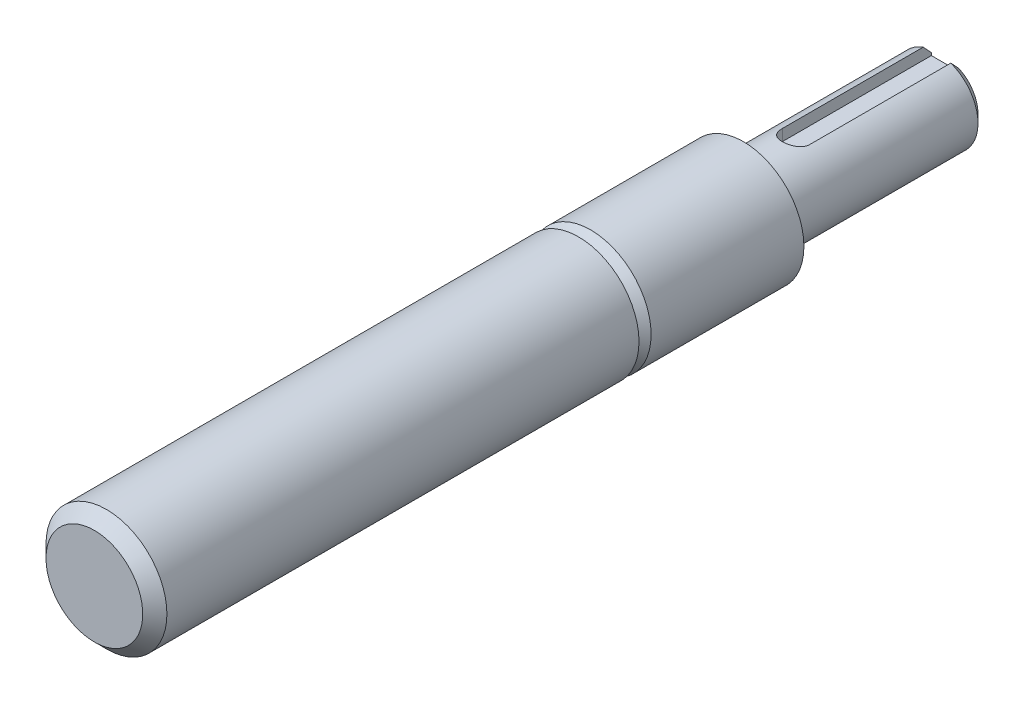
ISO-10303-21;
HEADER;
FILE_DESCRIPTION(('STEP AP214'),'2;1');
FILE_NAME('part.step','',(''),(''),'','','');
FILE_SCHEMA(('AUTOMOTIVE_DESIGN { 1 0 10303 214 1 1 1 1 }'));
ENDSEC;
DATA;
#1=APPLICATION_CONTEXT('core data for automotive mechanical design processes');
#2=APPLICATION_PROTOCOL_DEFINITION('international standard','automotive_design',2000,#1);
#3=PRODUCT_CONTEXT('',#1,'mechanical');
#4=PRODUCT('Part','Part','',(#3));
#5=PRODUCT_RELATED_PRODUCT_CATEGORY('part','',(#4));
#6=PRODUCT_DEFINITION_FORMATION('','',#4);
#7=PRODUCT_DEFINITION_CONTEXT('part definition',#1,'design');
#8=PRODUCT_DEFINITION('design','',#6,#7);
#9=PRODUCT_DEFINITION_SHAPE('','',#8);
#10=(LENGTH_UNIT() NAMED_UNIT(*) SI_UNIT(.MILLI.,.METRE.));
#11=(NAMED_UNIT(*) PLANE_ANGLE_UNIT() SI_UNIT($,.RADIAN.));
#12=(NAMED_UNIT(*) SI_UNIT($,.STERADIAN.) SOLID_ANGLE_UNIT());
#13=UNCERTAINTY_MEASURE_WITH_UNIT(LENGTH_MEASURE(1.E-05),#10,'distance_accuracy_value','');
#14=(GEOMETRIC_REPRESENTATION_CONTEXT(3) GLOBAL_UNCERTAINTY_ASSIGNED_CONTEXT((#13)) GLOBAL_UNIT_ASSIGNED_CONTEXT((#10,
#11,#12)) REPRESENTATION_CONTEXT('',''));
#15=CARTESIAN_POINT('',(0.,0.,0.));
#16=DIRECTION('',(0.,0.,1.));
#17=DIRECTION('',(1.,0.,0.));
#18=AXIS2_PLACEMENT_3D('',#15,#16,#17);
#19=CARTESIAN_POINT('',(0.,1.5748,-40.64));
#20=DIRECTION('',(0.,1.,0.));
#21=DIRECTION('',(0.,0.,1.));
#22=AXIS2_PLACEMENT_3D('',#19,#20,#21);
#23=PLANE('',#22);
#24=CARTESIAN_POINT('',(0.,1.5748,-40.64));
#25=DIRECTION('',(0.,1.,0.));
#26=DIRECTION('',(0.,0.,1.));
#27=AXIS2_PLACEMENT_3D('',#24,#25,#26);
#28=CIRCLE('',#27,0.800100000000012);
#29=CARTESIAN_POINT('',(-0.80010000000001,1.5748,-40.64));
#30=VERTEX_POINT('',#29);
#31=CARTESIAN_POINT('',(0.800100000000011,1.5748,-40.64));
#32=VERTEX_POINT('',#31);
#33=EDGE_CURVE('E75',#30,#32,#28,.T.);
#34=ORIENTED_EDGE('',*,*,#33,.T.);
#35=DIRECTION('',(0.,0.,-1.));
#36=VECTOR('',#35,1.);
#37=CARTESIAN_POINT('',(0.80010000000001,1.5748,-40.64));
#38=LINE('',#37,#36);
#39=CARTESIAN_POINT('',(0.80010000000001,1.5748,-49.276));
#40=VERTEX_POINT('',#39);
#41=EDGE_CURVE('E71',#32,#40,#38,.T.);
#42=ORIENTED_EDGE('',*,*,#41,.T.);
#43=DIRECTION('',(1.,0.,0.));
#44=VECTOR('',#43,1.);
#45=CARTESIAN_POINT('',(0.,1.5748,-49.276));
#46=LINE('',#45,#44);
#47=CARTESIAN_POINT('',(-0.80010000000001,1.5748,-49.276));
#48=VERTEX_POINT('',#47);
#49=EDGE_CURVE('E73',#40,#48,#46,.F.);
#50=ORIENTED_EDGE('',*,*,#49,.T.);
#51=DIRECTION('',(0.,0.,1.));
#52=VECTOR('',#51,1.);
#53=CARTESIAN_POINT('',(-0.80010000000001,1.5748,-49.276));
#54=LINE('',#53,#52);
#55=EDGE_CURVE('E98',#48,#30,#54,.T.);
#56=ORIENTED_EDGE('',*,*,#55,.T.);
#57=EDGE_LOOP('',(#34,#42,#50,#56));
#58=FACE_BOUND('',#57,.T.);
#59=ADVANCED_FACE('F17',(#58),#23,.T.);
#60=CARTESIAN_POINT('',(0.,1.89992,-49.276));
#61=DIRECTION('',(0.,0.,1.));
#62=DIRECTION('',(1.,0.,0.));
#63=AXIS2_PLACEMENT_3D('',#60,#61,#62);
#64=PLANE('',#63);
#65=DIRECTION('',(0.,1.,0.));
#66=VECTOR('',#65,1.);
#67=CARTESIAN_POINT('',(0.80010000000001,1.5748,-49.276));
#68=LINE('',#67,#66);
#69=CARTESIAN_POINT('',(0.80010000000001,1.7232341677094,-49.2760000000101));
#70=VERTEX_POINT('',#69);
#71=EDGE_CURVE('E80',#40,#70,#68,.T.);
#72=ORIENTED_EDGE('',*,*,#71,.T.);
#73=CARTESIAN_POINT('',(0.,0.,-49.2760000000203));
#74=DIRECTION('',(0.,0.,1.));
#75=DIRECTION('',(1.,0.,0.));
#76=AXIS2_PLACEMENT_3D('',#73,#74,#75);
#77=CIRCLE('',#76,1.89992000008488);
#78=CARTESIAN_POINT('',(-0.80010000000001,1.72323416768079,-49.2760000000361));
#79=VERTEX_POINT('',#78);
#80=EDGE_CURVE('E65',#79,#70,#77,.T.);
#81=ORIENTED_EDGE('',*,*,#80,.F.);
#82=DIRECTION('',(0.,1.,0.));
#83=VECTOR('',#82,1.);
#84=CARTESIAN_POINT('',(-0.80010000000001,1.5748,-49.276));
#85=LINE('',#84,#83);
#86=EDGE_CURVE('E86',#79,#48,#85,.F.);
#87=ORIENTED_EDGE('',*,*,#86,.T.);
#88=ORIENTED_EDGE('',*,*,#49,.F.);
#89=EDGE_LOOP('',(#72,#81,#87,#88));
#90=FACE_BOUND('',#89,.T.);
#91=ADVANCED_FACE('F83',(#90),#64,.F.);
#92=CARTESIAN_POINT('',(0.80010000000001,1.5748,-40.64));
#93=DIRECTION('',(1.,0.,0.));
#94=DIRECTION('',(0.,0.,-1.));
#95=AXIS2_PLACEMENT_3D('',#92,#93,#94);
#96=PLANE('',#95);
#97=ORIENTED_EDGE('',*,*,#71,.F.);
#98=ORIENTED_EDGE('',*,*,#41,.F.);
#99=DIRECTION('',(0.,1.,0.));
#100=VECTOR('',#99,1.);
#101=CARTESIAN_POINT('',(0.800100000000012,1.5748,-40.64));
#102=LINE('',#101,#100);
#103=CARTESIAN_POINT('',(0.800100000000011,2.23606574143069,-40.64));
#104=VERTEX_POINT('',#103);
#105=EDGE_CURVE('E92',#32,#104,#102,.T.);
#106=ORIENTED_EDGE('',*,*,#105,.T.);
#107=DIRECTION('',(0.,0.,1.));
#108=VECTOR('',#107,1.);
#109=CARTESIAN_POINT('',(0.800100000000008,2.23606574143069,0.));
#110=LINE('',#109,#108);
#111=CARTESIAN_POINT('',(0.800100000000009,2.23606574144276,-48.8010200000128));
#112=VERTEX_POINT('',#111);
#113=EDGE_CURVE('E131',#112,#104,#110,.T.);
#114=ORIENTED_EDGE('',*,*,#113,.F.);
#115=CARTESIAN_POINT('',(0.800099999983486,1.72323416765522,-49.2760000000429));
#116=CARTESIAN_POINT('',(0.800099999994043,1.76638009767997,-49.2368628614948));
#117=CARTESIAN_POINT('',(0.800099999998404,1.80939973556776,-49.1975870135849));
#118=CARTESIAN_POINT('',(0.800100000001617,1.89522281064277,-49.1188015560433));
#119=CARTESIAN_POINT('',(0.800100000000469,1.93802625239843,-49.0792919513897));
#120=CARTESIAN_POINT('',(0.800099999999551,2.0234548660343,-49.0000812330134));
#121=CARTESIAN_POINT('',(0.800099999999781,2.0660800390842,-48.960380120551));
#122=CARTESIAN_POINT('',(0.80010000000024,2.15117961660351,-48.8808147990463));
#123=CARTESIAN_POINT('',(0.800100000000469,2.19365401786432,-48.8409505865714));
#124=CARTESIAN_POINT('',(0.80010000000001,2.23606574145483,-48.8010200000256));
#125=B_SPLINE_CURVE_WITH_KNOTS('',3,(#115,#116,#117,#118,#119,#120,#121,#122,#123,#124),
.UNSPECIFIED.,.F.,.F.,(4,2,2,2,4),(0.,0.174754976200461,0.349506244075828,0.524256363532126,
0.699010179823642),.UNSPECIFIED.);
#126=EDGE_CURVE('E20',#70,#112,#125,.T.);
#127=ORIENTED_EDGE('',*,*,#126,.F.);
#128=EDGE_LOOP('',(#97,#98,#106,#114,#127));
#129=FACE_BOUND('',#128,.T.);
#130=ADVANCED_FACE('F89',(#129),#96,.F.);
#131=CARTESIAN_POINT('',(0.,1.5748,-40.64));
#132=DIRECTION('',(0.,1.,0.));
#133=DIRECTION('',(0.,0.,1.));
#134=AXIS2_PLACEMENT_3D('',#131,#132,#133);
#135=CYLINDRICAL_SURFACE('',#134,0.800100000000012);
#136=ORIENTED_EDGE('',*,*,#33,.F.);
#137=DIRECTION('',(0.,1.,0.));
#138=VECTOR('',#137,1.);
#139=CARTESIAN_POINT('',(-0.80010000000001,1.5748,-40.64));
#140=LINE('',#139,#138);
#141=CARTESIAN_POINT('',(-0.80010000000001,2.23606574143069,-40.64));
#142=VERTEX_POINT('',#141);
#143=EDGE_CURVE('E40',#30,#142,#140,.T.);
#144=ORIENTED_EDGE('',*,*,#143,.T.);
#145=CARTESIAN_POINT('',(0.800100000000012,2.23606574143069,-40.64));
#146=CARTESIAN_POINT('',(0.800143894851925,2.2360136099605,-40.5963562182625));
#147=CARTESIAN_POINT('',(0.796532270676062,2.23734229770421,-40.5527542382266));
#148=CARTESIAN_POINT('',(0.782358123627072,2.24235689995222,-40.4669664865681));
#149=CARTESIAN_POINT('',(0.771817055303551,2.24603553768576,-40.4247767647536));
#150=CARTESIAN_POINT('',(0.744147941533705,2.25534760353741,-40.3428852981415));
#151=CARTESIAN_POINT('',(0.727023582578488,2.26097993745847,-40.3031821753498));
#152=CARTESIAN_POINT('',(0.686725631119778,2.27354464654018,-40.2271824461956));
#153=CARTESIAN_POINT('',(0.663548395583277,2.2804778039149,-40.1908879092996));
#154=CARTESIAN_POINT('',(0.610817607645384,2.29517428940564,-40.1213136930058));
#155=CARTESIAN_POINT('',(0.581064515643499,2.30295852039776,-40.0881896219357));
#156=CARTESIAN_POINT('',(0.516444810596614,2.31830465336282,-40.0272875921198));
#157=CARTESIAN_POINT('',(0.481576399545857,2.32586647603392,-39.9995115211368));
#158=CARTESIAN_POINT('',(0.406559447170652,2.34016135525424,-39.9493775871719));
#159=CARTESIAN_POINT('',(0.366293378693093,2.34686638292875,-39.9271870451617));
#160=CARTESIAN_POINT('',(0.282359839084325,2.3584337205911,-39.8899769919749));
#161=CARTESIAN_POINT('',(0.238696623985161,2.36329829291874,-39.8749486708511));
#162=CARTESIAN_POINT('',(0.162370396620734,2.3695563930086,-39.8558693073195));
#163=CARTESIAN_POINT('',(0.130224717445415,2.37154897367814,-39.8498932932528));
#164=CARTESIAN_POINT('',(0.0653900338250648,2.37422123874788,-39.8419080702059));
#165=CARTESIAN_POINT('',(0.0327010609453921,2.37490099915584,-39.8398986315745));
#166=CARTESIAN_POINT('',(-0.0435993222548141,2.37489866785614,-39.8399018244797));
#167=CARTESIAN_POINT('',(-0.0872201323418129,2.37368721263855,-39.8434780739777));
#168=CARTESIAN_POINT('',(-0.173196952252313,2.36896847697074,-39.8576542979316));
#169=CARTESIAN_POINT('',(-0.215551860969249,2.36545925535003,-39.8682602111938));
#170=CARTESIAN_POINT('',(-0.2977114507667,2.35652770104203,-39.8960878431723));
#171=CARTESIAN_POINT('',(-0.337521084778502,2.35110922634043,-39.9132962266091));
#172=CARTESIAN_POINT('',(-0.413683250941343,2.33891125191427,-39.9537876094993));
#173=CARTESIAN_POINT('',(-0.450035493908258,2.33213163848824,-39.9770711164814));
#174=CARTESIAN_POINT('',(-0.519541423952271,2.31765566261017,-40.0299157207726));
#175=CARTESIAN_POINT('',(-0.552556413367581,2.30993698374464,-40.0596530940408));
#176=CARTESIAN_POINT('',(-0.613239113462391,2.2945739384357,-40.1241896043019));
#177=CARTESIAN_POINT('',(-0.640905297718502,2.28692959379487,-40.1589901812633));
#178=CARTESIAN_POINT('',(-0.690908391668962,2.27233274147249,-40.2339280437599));
#179=CARTESIAN_POINT('',(-0.713061764455194,2.26540766464416,-40.2741935317481));
#180=CARTESIAN_POINT('',(-0.750209068429673,2.25337961788297,-40.3581348558463));
#181=CARTESIAN_POINT('',(-0.765210321738499,2.24827478579545,-40.4018071506244));
#182=CARTESIAN_POINT('',(-0.784214584832836,2.24170216040376,-40.4780599275675));
#183=CARTESIAN_POINT('',(-0.790156059641204,2.23960584381116,-40.5101155445319));
#184=CARTESIAN_POINT('',(-0.798104509808264,2.2367797964067,-40.5747731930836));
#185=CARTESIAN_POINT('',(-0.800110948346774,2.2360502520514,-40.6073752986115));
#186=CARTESIAN_POINT('',(-0.800100000000012,2.23606574143069,-40.64));
#187=B_SPLINE_CURVE_WITH_KNOTS('',3,(#145,#146,#147,#148,#149,#150,#151,#152,#153,#154,#155,
#156,#157,#158,#159,#160,#161,#162,#163,#164,#165,#166,#167,#168,#169,#170,#171,#172,#173,#174,
#175,#176,#177,#178,#179,#180,#181,#182,#183,#184,#185,#186),.UNSPECIFIED.,.F.,.F.,(4,2,2,2,2,2,
2,2,2,2,2,2,2,2,2,2,2,2,2,2,4),(0.,0.130696837978222,0.260990913771946,0.391212133911442,
0.52151191139748,0.656503308236932,0.791542267982385,0.930242509756962,1.06877169900926,
1.16678842228377,1.26479947055834,1.39547459713547,1.52626026173295,1.65678315200391,
1.78731694992557,1.92200699752223,2.05673542594185,2.19548177023377,2.33408576362738,
2.43183590411403,2.52959937881051),.UNSPECIFIED.);
#188=EDGE_CURVE('E122',#104,#142,#187,.T.);
#189=ORIENTED_EDGE('',*,*,#188,.F.);
#190=ORIENTED_EDGE('',*,*,#105,.F.);
#191=EDGE_LOOP('',(#136,#144,#189,#190));
#192=FACE_BOUND('',#191,.T.);
#193=ADVANCED_FACE('F133',(#192),#135,.F.);
#194=CARTESIAN_POINT('',(-0.80010000000001,1.5748,-49.276));
#195=DIRECTION('',(-1.,0.,0.));
#196=DIRECTION('',(0.,0.,1.));
#197=AXIS2_PLACEMENT_3D('',#194,#195,#196);
#198=PLANE('',#197);
#199=ORIENTED_EDGE('',*,*,#55,.F.);
#200=ORIENTED_EDGE('',*,*,#86,.F.);
#201=CARTESIAN_POINT('',(-0.80010000000001,2.23606574145483,-48.8010200000256));
#202=CARTESIAN_POINT('',(-0.80010000000001,2.1936540178641,-48.8409505865711));
#203=CARTESIAN_POINT('',(-0.80010000000001,2.15117961660341,-48.8808147990461));
#204=CARTESIAN_POINT('',(-0.80010000000001,2.06608003908435,-48.9603801205511));
#205=CARTESIAN_POINT('',(-0.80010000000001,2.02345486603456,-49.0000812330137));
#206=CARTESIAN_POINT('',(-0.80010000000001,1.93802625239824,-49.0792919513894));
#207=CARTESIAN_POINT('',(-0.80010000000001,1.89522281064203,-49.1188015560424));
#208=CARTESIAN_POINT('',(-0.80010000000001,1.80939973556865,-49.1975870135857));
#209=CARTESIAN_POINT('',(-0.80010000000001,1.76638009768305,-49.236862861498));
#210=CARTESIAN_POINT('',(-0.80010000000001,1.72323416766356,-49.2760000000517));
#211=B_SPLINE_CURVE_WITH_KNOTS('',3,(#201,#202,#203,#204,#205,#206,#207,#208,#209,#210),
.UNSPECIFIED.,.F.,.F.,(4,2,2,2,4),(0.,0.174753816291473,0.349503935747769,0.524255203623079,
0.69901017982345),.UNSPECIFIED.);
#212=CARTESIAN_POINT('',(-0.80010000000001,2.23606574144276,-48.8010200000128));
#213=VERTEX_POINT('',#212);
#214=EDGE_CURVE('E149',#213,#79,#211,.T.);
#215=ORIENTED_EDGE('',*,*,#214,.F.);
#216=DIRECTION('',(0.,0.,1.));
#217=VECTOR('',#216,1.);
#218=CARTESIAN_POINT('',(-0.80010000000001,2.23606574143069,0.));
#219=LINE('',#218,#217);
#220=EDGE_CURVE('E130',#142,#213,#219,.F.);
#221=ORIENTED_EDGE('',*,*,#220,.F.);
#222=ORIENTED_EDGE('',*,*,#143,.F.);
#223=EDGE_LOOP('',(#199,#200,#215,#221,#222));
#224=FACE_BOUND('',#223,.T.);
#225=ADVANCED_FACE('F146',(#224),#198,.F.);
#226=CARTESIAN_POINT('',(0.,0.,-48.8010200000986));
#227=DIRECTION('',(0.,0.,1.));
#228=DIRECTION('',(1.,0.,0.));
#229=AXIS2_PLACEMENT_3D('',#226,#227,#228);
#230=CONICAL_SURFACE('',#229,2.37489999994978,0.785398163337611);
#231=ORIENTED_EDGE('',*,*,#80,.T.);
#232=ORIENTED_EDGE('',*,*,#126,.T.);
#233=CARTESIAN_POINT('',(0.,0.,-48.80102));
#234=DIRECTION('',(0.,0.,1.));
#235=DIRECTION('',(1.,0.,0.));
#236=AXIS2_PLACEMENT_3D('',#233,#234,#235);
#237=CIRCLE('',#236,2.3749);
#238=EDGE_CURVE('E156',#213,#112,#237,.T.);
#239=ORIENTED_EDGE('',*,*,#238,.F.);
#240=ORIENTED_EDGE('',*,*,#214,.T.);
#241=EDGE_LOOP('',(#231,#232,#239,#240));
#242=FACE_BOUND('',#241,.T.);
#243=ADVANCED_FACE('F141',(#242),#230,.T.);
#244=CARTESIAN_POINT('',(0.,0.,0.));
#245=DIRECTION('',(0.,0.,1.));
#246=DIRECTION('',(1.,0.,0.));
#247=AXIS2_PLACEMENT_3D('',#244,#245,#246);
#248=CYLINDRICAL_SURFACE('',#247,2.3749);
#249=ORIENTED_EDGE('',*,*,#220,.T.);
#250=ORIENTED_EDGE('',*,*,#238,.T.);
#251=ORIENTED_EDGE('',*,*,#113,.T.);
#252=ORIENTED_EDGE('',*,*,#188,.T.);
#253=EDGE_LOOP('',(#249,#250,#251,#252));
#254=FACE_BOUND('',#253,.T.);
#255=CARTESIAN_POINT('',(0.,0.,-38.0669800000533));
#256=DIRECTION('',(0.,0.,-1.));
#257=DIRECTION('',(-1.,0.,0.));
#258=AXIS2_PLACEMENT_3D('',#255,#256,#257);
#259=CIRCLE('',#258,2.37490000003504);
#260=CARTESIAN_POINT('',(-2.37490000003504,0.,-38.0669800000533));
#261=VERTEX_POINT('',#260);
#262=EDGE_CURVE('E121',#261,#261,#259,.F.);
#263=ORIENTED_EDGE('',*,*,#262,.F.);
#264=EDGE_LOOP('',(#263));
#265=FACE_BOUND('',#264,.T.);
#266=ADVANCED_FACE('F136',(#254,#265),#248,.T.);
#267=CARTESIAN_POINT('',(0.,0.,-38.0669799998259));
#268=DIRECTION('',(0.,0.,-1.));
#269=DIRECTION('',(-1.,0.,0.));
#270=AXIS2_PLACEMENT_3D('',#267,#268,#269);
#271=CONICAL_SURFACE('',#270,2.37489999992135,0.463647609000806);
#272=CARTESIAN_POINT('',(0.,0.,-37.5920000000178));
#273=DIRECTION('',(0.,0.,-1.));
#274=DIRECTION('',(-1.,0.,0.));
#275=AXIS2_PLACEMENT_3D('',#272,#273,#274);
#276=CIRCLE('',#275,2.13741000001733);
#277=CARTESIAN_POINT('',(-2.13741000001733,0.,-37.5920000000178));
#278=VERTEX_POINT('',#277);
#279=EDGE_CURVE('E118',#278,#278,#276,.T.);
#280=ORIENTED_EDGE('',*,*,#279,.T.);
#281=EDGE_LOOP('',(#280));
#282=FACE_BOUND('',#281,.T.);
#283=ORIENTED_EDGE('',*,*,#262,.T.);
#284=EDGE_LOOP('',(#283));
#285=FACE_BOUND('',#284,.T.);
#286=ADVANCED_FACE('F140',(#282,#285),#271,.T.);
#287=CARTESIAN_POINT('',(0.,3.50139,-37.592));
#288=DIRECTION('',(0.,0.,1.));
#289=DIRECTION('',(1.,0.,0.));
#290=AXIS2_PLACEMENT_3D('',#287,#288,#289);
#291=PLANE('',#290);
#292=ORIENTED_EDGE('',*,*,#279,.F.);
#293=EDGE_LOOP('',(#292));
#294=FACE_BOUND('',#293,.T.);
#295=CARTESIAN_POINT('',(0.,0.,-37.592));
#296=DIRECTION('',(0.,0.,1.));
#297=DIRECTION('',(1.,0.,0.));
#298=AXIS2_PLACEMENT_3D('',#295,#296,#297);
#299=CIRCLE('',#298,3.50139);
#300=CARTESIAN_POINT('',(3.50139,0.,-37.592));
#301=VERTEX_POINT('',#300);
#302=EDGE_CURVE('E115',#301,#301,#299,.T.);
#303=ORIENTED_EDGE('',*,*,#302,.F.);
#304=EDGE_LOOP('',(#303));
#305=FACE_BOUND('',#304,.T.);
#306=ADVANCED_FACE('F201',(#294,#305),#291,.F.);
#307=CARTESIAN_POINT('',(0.,0.,0.));
#308=DIRECTION('',(0.,0.,1.));
#309=DIRECTION('',(1.,0.,0.));
#310=AXIS2_PLACEMENT_3D('',#307,#308,#309);
#311=CYLINDRICAL_SURFACE('',#310,3.50139);
#312=ORIENTED_EDGE('',*,*,#302,.T.);
#313=EDGE_LOOP('',(#312));
#314=FACE_BOUND('',#313,.T.);
#315=CARTESIAN_POINT('',(0.,0.,-28.7418780000053));
#316=DIRECTION('',(0.,0.,-1.));
#317=DIRECTION('',(-1.,0.,0.));
#318=AXIS2_PLACEMENT_3D('',#315,#316,#317);
#319=CIRCLE('',#318,3.50138999999672);
#320=CARTESIAN_POINT('',(-3.50138999999672,0.,-28.7418780000053));
#321=VERTEX_POINT('',#320);
#322=EDGE_CURVE('E114',#321,#321,#319,.F.);
#323=ORIENTED_EDGE('',*,*,#322,.F.);
#324=EDGE_LOOP('',(#323));
#325=FACE_BOUND('',#324,.T.);
#326=ADVANCED_FACE('F198',(#314,#325),#311,.T.);
#327=CARTESIAN_POINT('',(0.,0.,-28.7418779999484));
#328=DIRECTION('',(0.,0.,-1.));
#329=DIRECTION('',(-1.,0.,0.));
#330=AXIS2_PLACEMENT_3D('',#327,#328,#329);
#331=CONICAL_SURFACE('',#330,3.50138999993987,0.785398163356862);
#332=CARTESIAN_POINT('',(0.,0.,-28.0415999999946));
#333=DIRECTION('',(0.,0.,-1.));
#334=DIRECTION('',(-1.,0.,0.));
#335=AXIS2_PLACEMENT_3D('',#332,#333,#334);
#336=CIRCLE('',#335,2.80111200004285);
#337=CARTESIAN_POINT('',(-2.80111200004285,0.,-28.0415999999946));
#338=VERTEX_POINT('',#337);
#339=EDGE_CURVE('E111',#338,#338,#336,.T.);
#340=ORIENTED_EDGE('',*,*,#339,.T.);
#341=EDGE_LOOP('',(#340));
#342=FACE_BOUND('',#341,.T.);
#343=ORIENTED_EDGE('',*,*,#322,.T.);
#344=EDGE_LOOP('',(#343));
#345=FACE_BOUND('',#344,.T.);
#346=ADVANCED_FACE('F194',(#342,#345),#331,.T.);
#347=CARTESIAN_POINT('',(0.,0.,0.));
#348=DIRECTION('',(0.,0.,-1.));
#349=DIRECTION('',(-1.,0.,0.));
#350=AXIS2_PLACEMENT_3D('',#347,#348,#349);
#351=PLANE('',#350);
#352=CARTESIAN_POINT('',(0.,0.,0.));
#353=DIRECTION('',(0.,0.,-1.));
#354=DIRECTION('',(-1.,0.,0.));
#355=AXIS2_PLACEMENT_3D('',#352,#353,#354);
#356=CIRCLE('',#355,2.80111199992916);
#357=CARTESIAN_POINT('',(-2.80111199992916,0.,0.));
#358=VERTEX_POINT('',#357);
#359=EDGE_CURVE('E108',#358,#358,#356,.T.);
#360=ORIENTED_EDGE('',*,*,#359,.F.);
#361=EDGE_LOOP('',(#360));
#362=FACE_BOUND('',#361,.T.);
#363=ADVANCED_FACE('F190',(#362),#351,.F.);
#364=CARTESIAN_POINT('',(0.,3.50139,-28.0416));
#365=DIRECTION('',(0.,0.,1.));
#366=DIRECTION('',(1.,0.,0.));
#367=AXIS2_PLACEMENT_3D('',#364,#365,#366);
#368=PLANE('',#367);
#369=ORIENTED_EDGE('',*,*,#339,.F.);
#370=EDGE_LOOP('',(#369));
#371=FACE_BOUND('',#370,.T.);
#372=CARTESIAN_POINT('',(0.,0.,-28.0416));
#373=DIRECTION('',(0.,0.,1.));
#374=DIRECTION('',(1.,0.,0.));
#375=AXIS2_PLACEMENT_3D('',#372,#373,#374);
#376=CIRCLE('',#375,3.50139);
#377=CARTESIAN_POINT('',(3.50139,0.,-28.0416));
#378=VERTEX_POINT('',#377);
#379=EDGE_CURVE('E31',#378,#378,#376,.T.);
#380=ORIENTED_EDGE('',*,*,#379,.F.);
#381=EDGE_LOOP('',(#380));
#382=FACE_BOUND('',#381,.T.);
#383=ADVANCED_FACE('F183',(#371,#382),#368,.F.);
#384=CARTESIAN_POINT('',(0.,0.,-0.700278000067556));
#385=DIRECTION('',(0.,0.,-1.));
#386=DIRECTION('',(-1.,0.,0.));
#387=AXIS2_PLACEMENT_3D('',#384,#385,#386);
#388=CONICAL_SURFACE('',#387,3.50138999999672,0.785398163397448);
#389=CARTESIAN_POINT('',(0.,0.,-0.700278));
#390=DIRECTION('',(0.,0.,1.));
#391=DIRECTION('',(1.,0.,0.));
#392=AXIS2_PLACEMENT_3D('',#389,#390,#391);
#393=CIRCLE('',#392,3.50139);
#394=CARTESIAN_POINT('',(3.50139,0.,-0.700278));
#395=VERTEX_POINT('',#394);
#396=EDGE_CURVE('E11',#395,#395,#393,.F.);
#397=ORIENTED_EDGE('',*,*,#396,.F.);
#398=EDGE_LOOP('',(#397));
#399=FACE_BOUND('',#398,.T.);
#400=ORIENTED_EDGE('',*,*,#359,.T.);
#401=EDGE_LOOP('',(#400));
#402=FACE_BOUND('',#401,.T.);
#403=ADVANCED_FACE('F177',(#399,#402),#388,.T.);
#404=CARTESIAN_POINT('',(0.,0.,0.));
#405=DIRECTION('',(0.,0.,1.));
#406=DIRECTION('',(1.,0.,0.));
#407=AXIS2_PLACEMENT_3D('',#404,#405,#406);
#408=CYLINDRICAL_SURFACE('',#407,3.50139);
#409=ORIENTED_EDGE('',*,*,#396,.T.);
#410=EDGE_LOOP('',(#409));
#411=FACE_BOUND('',#410,.T.);
#412=ORIENTED_EDGE('',*,*,#379,.T.);
#413=EDGE_LOOP('',(#412));
#414=FACE_BOUND('',#413,.T.);
#415=ADVANCED_FACE('F175',(#411,#414),#408,.T.);
#416=CLOSED_SHELL('',(#59,#91,#130,#193,#225,#243,#266,#286,#306,#326,#346,#363,#383,#403,#415));
#417=MANIFOLD_SOLID_BREP('B1',#416);
#418=ADVANCED_BREP_SHAPE_REPRESENTATION('',(#18,#417),#14);
#419=SHAPE_DEFINITION_REPRESENTATION(#9,#418);
ENDSEC;
END-ISO-10303-21;
